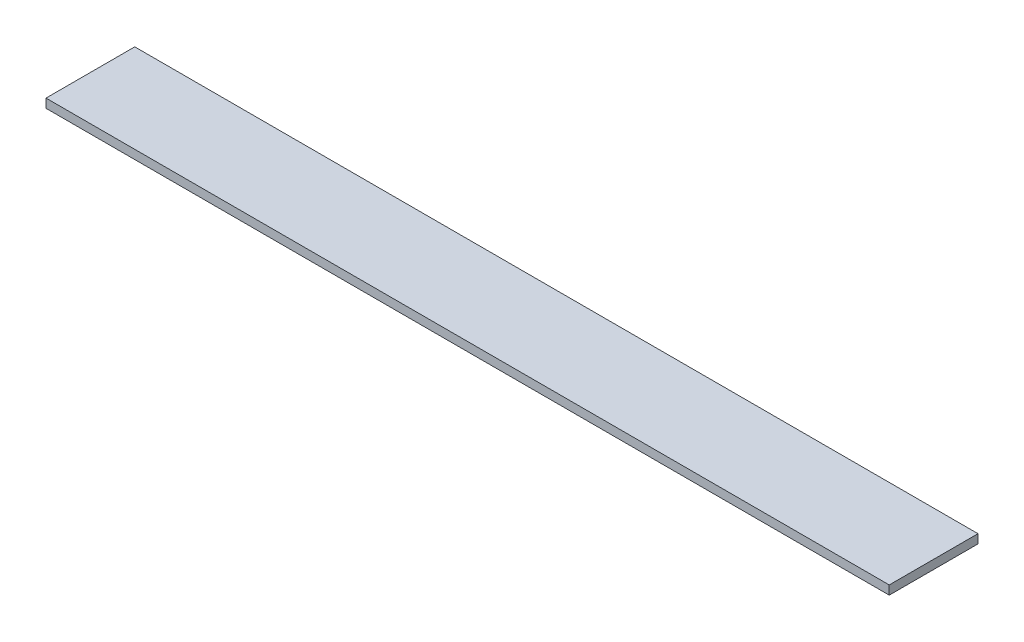
ISO-10303-21;
HEADER;
FILE_DESCRIPTION(('STEP AP214'),'2;1');
FILE_NAME('part.step','',(''),(''),'','','');
FILE_SCHEMA(('AUTOMOTIVE_DESIGN { 1 0 10303 214 1 1 1 1 }'));
ENDSEC;
DATA;
#1=APPLICATION_CONTEXT('core data for automotive mechanical design processes');
#2=APPLICATION_PROTOCOL_DEFINITION('international standard','automotive_design',2000,#1);
#3=PRODUCT_CONTEXT('',#1,'mechanical');
#4=PRODUCT('Part','Part','',(#3));
#5=PRODUCT_RELATED_PRODUCT_CATEGORY('part','',(#4));
#6=PRODUCT_DEFINITION_FORMATION('','',#4);
#7=PRODUCT_DEFINITION_CONTEXT('part definition',#1,'design');
#8=PRODUCT_DEFINITION('design','',#6,#7);
#9=PRODUCT_DEFINITION_SHAPE('','',#8);
#10=(LENGTH_UNIT() NAMED_UNIT(*) SI_UNIT(.MILLI.,.METRE.));
#11=(NAMED_UNIT(*) PLANE_ANGLE_UNIT() SI_UNIT($,.RADIAN.));
#12=(NAMED_UNIT(*) SI_UNIT($,.STERADIAN.) SOLID_ANGLE_UNIT());
#13=UNCERTAINTY_MEASURE_WITH_UNIT(LENGTH_MEASURE(1.E-05),#10,'distance_accuracy_value','');
#14=(GEOMETRIC_REPRESENTATION_CONTEXT(3) GLOBAL_UNCERTAINTY_ASSIGNED_CONTEXT((#13)) GLOBAL_UNIT_ASSIGNED_CONTEXT((#10,
#11,#12)) REPRESENTATION_CONTEXT('',''));
#15=CARTESIAN_POINT('',(0.,0.,0.));
#16=DIRECTION('',(0.,0.,1.));
#17=DIRECTION('',(1.,0.,0.));
#18=AXIS2_PLACEMENT_3D('',#15,#16,#17);
#19=CARTESIAN_POINT('',(0.,10.,0.));
#20=DIRECTION('',(1.,0.,0.));
#21=DIRECTION('',(0.,0.,-1.));
#22=AXIS2_PLACEMENT_3D('',#19,#20,#21);
#23=PLANE('',#22);
#24=DIRECTION('',(0.,0.,1.));
#25=VECTOR('',#24,1.);
#26=CARTESIAN_POINT('',(0.,0.,0.));
#27=LINE('',#26,#25);
#28=CARTESIAN_POINT('',(0.,0.,-100.));
#29=VERTEX_POINT('',#28);
#30=CARTESIAN_POINT('',(0.,0.,0.));
#31=VERTEX_POINT('',#30);
#32=EDGE_CURVE('E94',#29,#31,#27,.T.);
#33=ORIENTED_EDGE('',*,*,#32,.T.);
#34=DIRECTION('',(0.,-1.,0.));
#35=VECTOR('',#34,1.);
#36=CARTESIAN_POINT('',(0.,10.,0.));
#37=LINE('',#36,#35);
#38=CARTESIAN_POINT('',(0.,10.,0.));
#39=VERTEX_POINT('',#38);
#40=EDGE_CURVE('E11',#39,#31,#37,.T.);
#41=ORIENTED_EDGE('',*,*,#40,.F.);
#42=DIRECTION('',(0.,0.,1.));
#43=VECTOR('',#42,1.);
#44=CARTESIAN_POINT('',(0.,10.,0.));
#45=LINE('',#44,#43);
#46=CARTESIAN_POINT('',(0.,10.,-100.));
#47=VERTEX_POINT('',#46);
#48=EDGE_CURVE('E82',#47,#39,#45,.T.);
#49=ORIENTED_EDGE('',*,*,#48,.F.);
#50=DIRECTION('',(0.,-1.,0.));
#51=VECTOR('',#50,1.);
#52=CARTESIAN_POINT('',(0.,10.,-100.));
#53=LINE('',#52,#51);
#54=EDGE_CURVE('E90',#47,#29,#53,.T.);
#55=ORIENTED_EDGE('',*,*,#54,.T.);
#56=EDGE_LOOP('',(#33,#41,#49,#55));
#57=FACE_BOUND('',#56,.T.);
#58=ADVANCED_FACE('F31',(#57),#23,.F.);
#59=CARTESIAN_POINT('',(0.,10.,0.));
#60=DIRECTION('',(0.,0.,-1.));
#61=DIRECTION('',(-1.,0.,0.));
#62=AXIS2_PLACEMENT_3D('',#59,#60,#61);
#63=PLANE('',#62);
#64=DIRECTION('',(1.,0.,0.));
#65=VECTOR('',#64,1.);
#66=CARTESIAN_POINT('',(0.,0.,0.));
#67=LINE('',#66,#65);
#68=CARTESIAN_POINT('',(950.,0.,0.));
#69=VERTEX_POINT('',#68);
#70=EDGE_CURVE('E86',#31,#69,#67,.T.);
#71=ORIENTED_EDGE('',*,*,#70,.T.);
#72=DIRECTION('',(0.,-1.,0.));
#73=VECTOR('',#72,1.);
#74=CARTESIAN_POINT('',(950.,10.,0.));
#75=LINE('',#74,#73);
#76=CARTESIAN_POINT('',(950.,10.,0.));
#77=VERTEX_POINT('',#76);
#78=EDGE_CURVE('E39',#77,#69,#75,.T.);
#79=ORIENTED_EDGE('',*,*,#78,.F.);
#80=DIRECTION('',(1.,0.,0.));
#81=VECTOR('',#80,1.);
#82=CARTESIAN_POINT('',(0.,10.,0.));
#83=LINE('',#82,#81);
#84=EDGE_CURVE('E77',#39,#77,#83,.T.);
#85=ORIENTED_EDGE('',*,*,#84,.F.);
#86=ORIENTED_EDGE('',*,*,#40,.T.);
#87=EDGE_LOOP('',(#71,#79,#85,#86));
#88=FACE_BOUND('',#87,.T.);
#89=ADVANCED_FACE('F85',(#88),#63,.F.);
#90=CARTESIAN_POINT('',(950.,10.,0.));
#91=DIRECTION('',(-1.,0.,0.));
#92=DIRECTION('',(0.,0.,1.));
#93=AXIS2_PLACEMENT_3D('',#90,#91,#92);
#94=PLANE('',#93);
#95=DIRECTION('',(0.,0.,-1.));
#96=VECTOR('',#95,1.);
#97=CARTESIAN_POINT('',(950.,0.,0.));
#98=LINE('',#97,#96);
#99=CARTESIAN_POINT('',(950.,0.,-100.));
#100=VERTEX_POINT('',#99);
#101=EDGE_CURVE('E64',#69,#100,#98,.T.);
#102=ORIENTED_EDGE('',*,*,#101,.T.);
#103=DIRECTION('',(0.,-1.,0.));
#104=VECTOR('',#103,1.);
#105=CARTESIAN_POINT('',(950.,10.,-100.));
#106=LINE('',#105,#104);
#107=CARTESIAN_POINT('',(950.,10.,-100.));
#108=VERTEX_POINT('',#107);
#109=EDGE_CURVE('E87',#108,#100,#106,.T.);
#110=ORIENTED_EDGE('',*,*,#109,.F.);
#111=DIRECTION('',(0.,0.,-1.));
#112=VECTOR('',#111,1.);
#113=CARTESIAN_POINT('',(950.,10.,0.));
#114=LINE('',#113,#112);
#115=EDGE_CURVE('E80',#77,#108,#114,.T.);
#116=ORIENTED_EDGE('',*,*,#115,.F.);
#117=ORIENTED_EDGE('',*,*,#78,.T.);
#118=EDGE_LOOP('',(#102,#110,#116,#117));
#119=FACE_BOUND('',#118,.T.);
#120=ADVANCED_FACE('F88',(#119),#94,.F.);
#121=CARTESIAN_POINT('',(0.,10.,-100.));
#122=DIRECTION('',(0.,0.,1.));
#123=DIRECTION('',(1.,0.,0.));
#124=AXIS2_PLACEMENT_3D('',#121,#122,#123);
#125=PLANE('',#124);
#126=DIRECTION('',(-1.,0.,0.));
#127=VECTOR('',#126,1.);
#128=CARTESIAN_POINT('',(0.,0.,-100.));
#129=LINE('',#128,#127);
#130=EDGE_CURVE('E70',#100,#29,#129,.T.);
#131=ORIENTED_EDGE('',*,*,#130,.T.);
#132=ORIENTED_EDGE('',*,*,#54,.F.);
#133=DIRECTION('',(-1.,0.,0.));
#134=VECTOR('',#133,1.);
#135=CARTESIAN_POINT('',(0.,10.,-100.));
#136=LINE('',#135,#134);
#137=EDGE_CURVE('E47',#108,#47,#136,.T.);
#138=ORIENTED_EDGE('',*,*,#137,.F.);
#139=ORIENTED_EDGE('',*,*,#109,.T.);
#140=EDGE_LOOP('',(#131,#132,#138,#139));
#141=FACE_BOUND('',#140,.T.);
#142=ADVANCED_FACE('F101',(#141),#125,.F.);
#143=CARTESIAN_POINT('',(0.,10.,-100.));
#144=DIRECTION('',(0.,-1.,0.));
#145=DIRECTION('',(0.,0.,-1.));
#146=AXIS2_PLACEMENT_3D('',#143,#144,#145);
#147=PLANE('',#146);
#148=ORIENTED_EDGE('',*,*,#48,.T.);
#149=ORIENTED_EDGE('',*,*,#84,.T.);
#150=ORIENTED_EDGE('',*,*,#115,.T.);
#151=ORIENTED_EDGE('',*,*,#137,.T.);
#152=EDGE_LOOP('',(#148,#149,#150,#151));
#153=FACE_BOUND('',#152,.T.);
#154=ADVANCED_FACE('F78',(#153),#147,.F.);
#155=CARTESIAN_POINT('',(0.,0.,-100.));
#156=DIRECTION('',(0.,-1.,0.));
#157=DIRECTION('',(0.,0.,-1.));
#158=AXIS2_PLACEMENT_3D('',#155,#156,#157);
#159=PLANE('',#158);
#160=ORIENTED_EDGE('',*,*,#32,.F.);
#161=ORIENTED_EDGE('',*,*,#130,.F.);
#162=ORIENTED_EDGE('',*,*,#101,.F.);
#163=ORIENTED_EDGE('',*,*,#70,.F.);
#164=EDGE_LOOP('',(#160,#161,#162,#163));
#165=FACE_BOUND('',#164,.T.);
#166=ADVANCED_FACE('F104',(#165),#159,.T.);
#167=CLOSED_SHELL('',(#58,#89,#120,#142,#154,#166));
#168=MANIFOLD_SOLID_BREP('B2',#167);
#169=ADVANCED_BREP_SHAPE_REPRESENTATION('',(#18,#168),#14);
#170=SHAPE_DEFINITION_REPRESENTATION(#9,#169);
ENDSEC;
END-ISO-10303-21;
